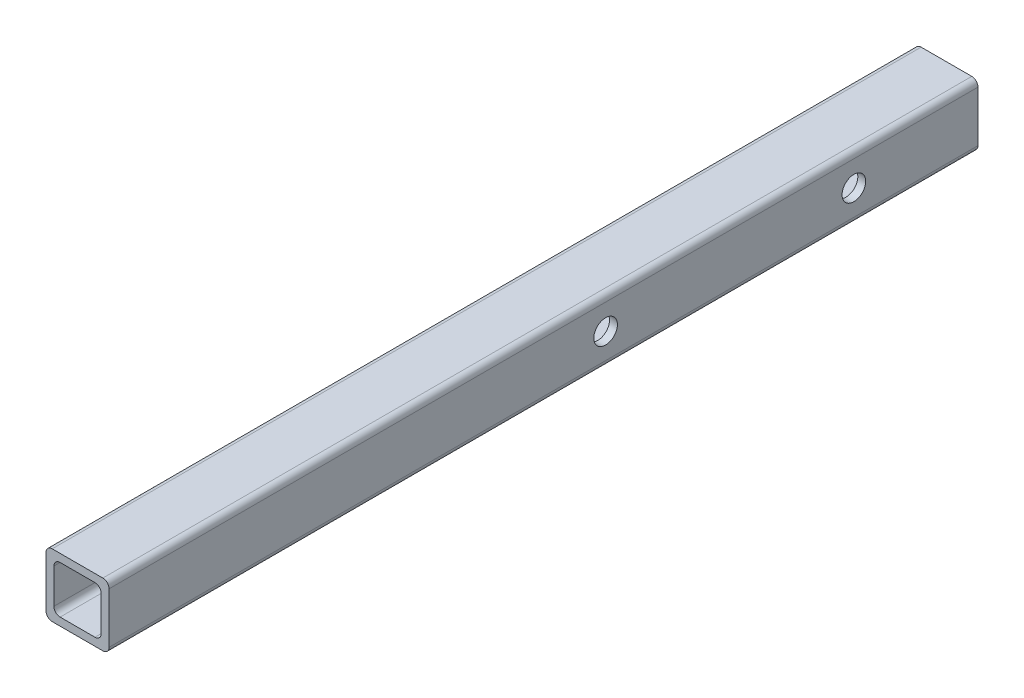
ISO-10303-21;
HEADER;
FILE_DESCRIPTION(('STEP AP214'),'2;1');
FILE_NAME('part.step','',(''),(''),'','','');
FILE_SCHEMA(('AUTOMOTIVE_DESIGN { 1 0 10303 214 1 1 1 1 }'));
ENDSEC;
DATA;
#1=APPLICATION_CONTEXT('core data for automotive mechanical design processes');
#2=APPLICATION_PROTOCOL_DEFINITION('international standard','automotive_design',2000,#1);
#3=PRODUCT_CONTEXT('',#1,'mechanical');
#4=PRODUCT('Part','Part','',(#3));
#5=PRODUCT_RELATED_PRODUCT_CATEGORY('part','',(#4));
#6=PRODUCT_DEFINITION_FORMATION('','',#4);
#7=PRODUCT_DEFINITION_CONTEXT('part definition',#1,'design');
#8=PRODUCT_DEFINITION('design','',#6,#7);
#9=PRODUCT_DEFINITION_SHAPE('','',#8);
#10=(LENGTH_UNIT() NAMED_UNIT(*) SI_UNIT(.MILLI.,.METRE.));
#11=(NAMED_UNIT(*) PLANE_ANGLE_UNIT() SI_UNIT($,.RADIAN.));
#12=(NAMED_UNIT(*) SI_UNIT($,.STERADIAN.) SOLID_ANGLE_UNIT());
#13=UNCERTAINTY_MEASURE_WITH_UNIT(LENGTH_MEASURE(1.E-05),#10,'distance_accuracy_value','');
#14=(GEOMETRIC_REPRESENTATION_CONTEXT(3) GLOBAL_UNCERTAINTY_ASSIGNED_CONTEXT((#13)) GLOBAL_UNIT_ASSIGNED_CONTEXT((#10,
#11,#12)) REPRESENTATION_CONTEXT('',''));
#15=CARTESIAN_POINT('',(0.,0.,0.));
#16=DIRECTION('',(0.,0.,1.));
#17=DIRECTION('',(1.,0.,0.));
#18=AXIS2_PLACEMENT_3D('',#15,#16,#17);
#19=CARTESIAN_POINT('',(10.2,-10.2,350.));
#20=DIRECTION('',(0.,0.,-1.));
#21=DIRECTION('',(-1.,0.,0.));
#22=AXIS2_PLACEMENT_3D('',#19,#20,#21);
#23=PLANE('',#22);
#24=CARTESIAN_POINT('',(10.2,-10.2,350.));
#25=DIRECTION('',(0.,0.,1.));
#26=DIRECTION('',(-1.,0.,0.));
#27=AXIS2_PLACEMENT_3D('',#24,#25,#26);
#28=CIRCLE('',#27,2.5);
#29=CARTESIAN_POINT('',(10.2,-12.7,350.));
#30=VERTEX_POINT('',#29);
#31=CARTESIAN_POINT('',(12.7,-10.2,350.));
#32=VERTEX_POINT('',#31);
#33=EDGE_CURVE('E245',#30,#32,#28,.T.);
#34=ORIENTED_EDGE('',*,*,#33,.T.);
#35=DIRECTION('',(0.,1.,0.));
#36=VECTOR('',#35,1.);
#37=CARTESIAN_POINT('',(12.7,-10.2,350.));
#38=LINE('',#37,#36);
#39=CARTESIAN_POINT('',(12.7,10.2,350.));
#40=VERTEX_POINT('',#39);
#41=EDGE_CURVE('E249',#32,#40,#38,.T.);
#42=ORIENTED_EDGE('',*,*,#41,.T.);
#43=CARTESIAN_POINT('',(10.2,10.2,350.));
#44=DIRECTION('',(0.,0.,1.));
#45=DIRECTION('',(1.,0.,0.));
#46=AXIS2_PLACEMENT_3D('',#43,#44,#45);
#47=CIRCLE('',#46,2.5);
#48=CARTESIAN_POINT('',(10.2,12.7,350.));
#49=VERTEX_POINT('',#48);
#50=EDGE_CURVE('E253',#40,#49,#47,.T.);
#51=ORIENTED_EDGE('',*,*,#50,.T.);
#52=DIRECTION('',(-1.,0.,0.));
#53=VECTOR('',#52,1.);
#54=CARTESIAN_POINT('',(-10.2,12.7,350.));
#55=LINE('',#54,#53);
#56=CARTESIAN_POINT('',(-10.2,12.7,350.));
#57=VERTEX_POINT('',#56);
#58=EDGE_CURVE('E256',#49,#57,#55,.T.);
#59=ORIENTED_EDGE('',*,*,#58,.T.);
#60=CARTESIAN_POINT('',(-10.2,10.2,350.));
#61=DIRECTION('',(0.,0.,1.));
#62=DIRECTION('',(1.,0.,0.));
#63=AXIS2_PLACEMENT_3D('',#60,#61,#62);
#64=CIRCLE('',#63,2.5);
#65=CARTESIAN_POINT('',(-12.7,10.2,350.));
#66=VERTEX_POINT('',#65);
#67=EDGE_CURVE('E259',#57,#66,#64,.T.);
#68=ORIENTED_EDGE('',*,*,#67,.T.);
#69=DIRECTION('',(0.,-1.,0.));
#70=VECTOR('',#69,1.);
#71=CARTESIAN_POINT('',(-12.7,-10.2,350.));
#72=LINE('',#71,#70);
#73=CARTESIAN_POINT('',(-12.7,-10.2,350.));
#74=VERTEX_POINT('',#73);
#75=EDGE_CURVE('E262',#66,#74,#72,.T.);
#76=ORIENTED_EDGE('',*,*,#75,.T.);
#77=CARTESIAN_POINT('',(-10.2,-10.2,350.));
#78=DIRECTION('',(0.,0.,1.));
#79=DIRECTION('',(-1.,0.,0.));
#80=AXIS2_PLACEMENT_3D('',#77,#78,#79);
#81=CIRCLE('',#80,2.5);
#82=CARTESIAN_POINT('',(-10.2,-12.7,350.));
#83=VERTEX_POINT('',#82);
#84=EDGE_CURVE('E265',#74,#83,#81,.T.);
#85=ORIENTED_EDGE('',*,*,#84,.T.);
#86=DIRECTION('',(1.,0.,0.));
#87=VECTOR('',#86,1.);
#88=CARTESIAN_POINT('',(-10.2,-12.7,350.));
#89=LINE('',#88,#87);
#90=EDGE_CURVE('E268',#83,#30,#89,.T.);
#91=ORIENTED_EDGE('',*,*,#90,.T.);
#92=EDGE_LOOP('',(#34,#42,#51,#59,#68,#76,#85,#91));
#93=FACE_BOUND('',#92,.T.);
#94=CARTESIAN_POINT('',(-7.02500000000001,-7.02499999999998,350.));
#95=DIRECTION('',(0.,0.,1.));
#96=DIRECTION('',(-1.,0.,0.));
#97=AXIS2_PLACEMENT_3D('',#94,#95,#96);
#98=CIRCLE('',#97,2.5);
#99=CARTESIAN_POINT('',(-9.52500000000001,-7.02499999999998,350.));
#100=VERTEX_POINT('',#99);
#101=CARTESIAN_POINT('',(-7.02500000000001,-9.52499999999998,350.));
#102=VERTEX_POINT('',#101);
#103=EDGE_CURVE('E154',#100,#102,#98,.T.);
#104=ORIENTED_EDGE('',*,*,#103,.F.);
#105=DIRECTION('',(0.,-1.,0.));
#106=VECTOR('',#105,1.);
#107=CARTESIAN_POINT('',(-9.52500000000001,-7.02499999999998,350.));
#108=LINE('',#107,#106);
#109=CARTESIAN_POINT('',(-9.52500000000001,7.025,350.));
#110=VERTEX_POINT('',#109);
#111=EDGE_CURVE('E196',#110,#100,#108,.T.);
#112=ORIENTED_EDGE('',*,*,#111,.F.);
#113=CARTESIAN_POINT('',(-7.025,7.025,350.));
#114=DIRECTION('',(0.,0.,1.));
#115=DIRECTION('',(-1.,0.,0.));
#116=AXIS2_PLACEMENT_3D('',#113,#114,#115);
#117=CIRCLE('',#116,2.5);
#118=CARTESIAN_POINT('',(-7.025,9.52500000000001,350.));
#119=VERTEX_POINT('',#118);
#120=EDGE_CURVE('E193',#119,#110,#117,.T.);
#121=ORIENTED_EDGE('',*,*,#120,.F.);
#122=DIRECTION('',(-1.,0.,0.));
#123=VECTOR('',#122,1.);
#124=CARTESIAN_POINT('',(-7.025,9.52500000000001,350.));
#125=LINE('',#124,#123);
#126=CARTESIAN_POINT('',(7.02499999999999,9.52500000000001,350.));
#127=VERTEX_POINT('',#126);
#128=EDGE_CURVE('E190',#127,#119,#125,.T.);
#129=ORIENTED_EDGE('',*,*,#128,.F.);
#130=CARTESIAN_POINT('',(7.02499999999999,7.025,350.));
#131=DIRECTION('',(0.,0.,1.));
#132=DIRECTION('',(1.,0.,0.));
#133=AXIS2_PLACEMENT_3D('',#130,#131,#132);
#134=CIRCLE('',#133,2.5);
#135=CARTESIAN_POINT('',(9.52499999999999,7.025,350.));
#136=VERTEX_POINT('',#135);
#137=EDGE_CURVE('E187',#136,#127,#134,.T.);
#138=ORIENTED_EDGE('',*,*,#137,.F.);
#139=DIRECTION('',(0.,1.,0.));
#140=VECTOR('',#139,1.);
#141=CARTESIAN_POINT('',(9.52499999999999,-7.02499999999998,350.));
#142=LINE('',#141,#140);
#143=CARTESIAN_POINT('',(9.52499999999999,-7.02499999999998,350.));
#144=VERTEX_POINT('',#143);
#145=EDGE_CURVE('E181',#144,#136,#142,.T.);
#146=ORIENTED_EDGE('',*,*,#145,.F.);
#147=CARTESIAN_POINT('',(7.02499999999999,-7.02499999999998,350.));
#148=DIRECTION('',(0.,0.,1.));
#149=DIRECTION('',(1.,0.,0.));
#150=AXIS2_PLACEMENT_3D('',#147,#148,#149);
#151=CIRCLE('',#150,2.5);
#152=CARTESIAN_POINT('',(7.02499999999999,-9.52499999999998,350.));
#153=VERTEX_POINT('',#152);
#154=EDGE_CURVE('E177',#153,#144,#151,.T.);
#155=ORIENTED_EDGE('',*,*,#154,.F.);
#156=DIRECTION('',(1.,0.,0.));
#157=VECTOR('',#156,1.);
#158=CARTESIAN_POINT('',(-7.02500000000001,-9.52499999999998,350.));
#159=LINE('',#158,#157);
#160=EDGE_CURVE('E163',#102,#153,#159,.T.);
#161=ORIENTED_EDGE('',*,*,#160,.F.);
#162=EDGE_LOOP('',(#104,#112,#121,#129,#138,#146,#155,#161));
#163=FACE_BOUND('',#162,.T.);
#164=ADVANCED_FACE('F38',(#93,#163),#23,.F.);
#165=CARTESIAN_POINT('',(10.2,-10.2,0.));
#166=DIRECTION('',(0.,0.,-1.));
#167=DIRECTION('',(-1.,0.,0.));
#168=AXIS2_PLACEMENT_3D('',#165,#166,#167);
#169=PLANE('',#168);
#170=CARTESIAN_POINT('',(10.2,-10.2,0.));
#171=DIRECTION('',(0.,0.,1.));
#172=DIRECTION('',(-1.,0.,0.));
#173=AXIS2_PLACEMENT_3D('',#170,#171,#172);
#174=CIRCLE('',#173,2.5);
#175=CARTESIAN_POINT('',(10.2,-12.7,0.));
#176=VERTEX_POINT('',#175);
#177=CARTESIAN_POINT('',(12.7,-10.2,0.));
#178=VERTEX_POINT('',#177);
#179=EDGE_CURVE('E172',#176,#178,#174,.T.);
#180=ORIENTED_EDGE('',*,*,#179,.F.);
#181=DIRECTION('',(1.,0.,0.));
#182=VECTOR('',#181,1.);
#183=CARTESIAN_POINT('',(-10.2,-12.7,0.));
#184=LINE('',#183,#182);
#185=CARTESIAN_POINT('',(-10.2,-12.7,0.));
#186=VERTEX_POINT('',#185);
#187=EDGE_CURVE('E250',#186,#176,#184,.T.);
#188=ORIENTED_EDGE('',*,*,#187,.F.);
#189=CARTESIAN_POINT('',(-10.2,-10.2,0.));
#190=DIRECTION('',(0.,0.,1.));
#191=DIRECTION('',(-1.,0.,0.));
#192=AXIS2_PLACEMENT_3D('',#189,#190,#191);
#193=CIRCLE('',#192,2.5);
#194=CARTESIAN_POINT('',(-12.7,-10.2,0.));
#195=VERTEX_POINT('',#194);
#196=EDGE_CURVE('E290',#195,#186,#193,.T.);
#197=ORIENTED_EDGE('',*,*,#196,.F.);
#198=DIRECTION('',(0.,-1.,0.));
#199=VECTOR('',#198,1.);
#200=CARTESIAN_POINT('',(-12.7,-10.2,0.));
#201=LINE('',#200,#199);
#202=CARTESIAN_POINT('',(-12.7,10.2,0.));
#203=VERTEX_POINT('',#202);
#204=EDGE_CURVE('E287',#203,#195,#201,.T.);
#205=ORIENTED_EDGE('',*,*,#204,.F.);
#206=CARTESIAN_POINT('',(-10.2,10.2,0.));
#207=DIRECTION('',(0.,0.,1.));
#208=DIRECTION('',(1.,0.,0.));
#209=AXIS2_PLACEMENT_3D('',#206,#207,#208);
#210=CIRCLE('',#209,2.5);
#211=CARTESIAN_POINT('',(-10.2,12.7,0.));
#212=VERTEX_POINT('',#211);
#213=EDGE_CURVE('E284',#212,#203,#210,.T.);
#214=ORIENTED_EDGE('',*,*,#213,.F.);
#215=DIRECTION('',(-1.,0.,0.));
#216=VECTOR('',#215,1.);
#217=CARTESIAN_POINT('',(-10.2,12.7,0.));
#218=LINE('',#217,#216);
#219=CARTESIAN_POINT('',(10.2,12.7,0.));
#220=VERTEX_POINT('',#219);
#221=EDGE_CURVE('E281',#220,#212,#218,.T.);
#222=ORIENTED_EDGE('',*,*,#221,.F.);
#223=CARTESIAN_POINT('',(10.2,10.2,0.));
#224=DIRECTION('',(0.,0.,1.));
#225=DIRECTION('',(1.,0.,0.));
#226=AXIS2_PLACEMENT_3D('',#223,#224,#225);
#227=CIRCLE('',#226,2.5);
#228=CARTESIAN_POINT('',(12.7,10.2,0.));
#229=VERTEX_POINT('',#228);
#230=EDGE_CURVE('E278',#229,#220,#227,.T.);
#231=ORIENTED_EDGE('',*,*,#230,.F.);
#232=DIRECTION('',(0.,1.,0.));
#233=VECTOR('',#232,1.);
#234=CARTESIAN_POINT('',(12.7,-10.2,0.));
#235=LINE('',#234,#233);
#236=EDGE_CURVE('E275',#178,#229,#235,.T.);
#237=ORIENTED_EDGE('',*,*,#236,.F.);
#238=EDGE_LOOP('',(#180,#188,#197,#205,#214,#222,#231,#237));
#239=FACE_BOUND('',#238,.T.);
#240=DIRECTION('',(0.,-1.,0.));
#241=VECTOR('',#240,1.);
#242=CARTESIAN_POINT('',(-9.52500000000001,-7.02499999999998,0.));
#243=LINE('',#242,#241);
#244=CARTESIAN_POINT('',(-9.52500000000001,7.02500000000001,0.));
#245=VERTEX_POINT('',#244);
#246=CARTESIAN_POINT('',(-9.52500000000001,-7.02499999999998,0.));
#247=VERTEX_POINT('',#246);
#248=EDGE_CURVE('E164',#245,#247,#243,.T.);
#249=ORIENTED_EDGE('',*,*,#248,.T.);
#250=CARTESIAN_POINT('',(-7.02500000000001,-7.02499999999998,0.));
#251=DIRECTION('',(0.,0.,1.));
#252=DIRECTION('',(-1.,0.,0.));
#253=AXIS2_PLACEMENT_3D('',#250,#251,#252);
#254=CIRCLE('',#253,2.5);
#255=CARTESIAN_POINT('',(-7.02500000000001,-9.52499999999998,0.));
#256=VERTEX_POINT('',#255);
#257=EDGE_CURVE('E64',#247,#256,#254,.T.);
#258=ORIENTED_EDGE('',*,*,#257,.T.);
#259=DIRECTION('',(1.,0.,0.));
#260=VECTOR('',#259,1.);
#261=CARTESIAN_POINT('',(-7.02500000000001,-9.52499999999998,0.));
#262=LINE('',#261,#260);
#263=CARTESIAN_POINT('',(7.02499999999999,-9.52499999999998,0.));
#264=VERTEX_POINT('',#263);
#265=EDGE_CURVE('E170',#256,#264,#262,.T.);
#266=ORIENTED_EDGE('',*,*,#265,.T.);
#267=CARTESIAN_POINT('',(7.02499999999999,-7.02499999999998,0.));
#268=DIRECTION('',(0.,0.,1.));
#269=DIRECTION('',(1.,0.,0.));
#270=AXIS2_PLACEMENT_3D('',#267,#268,#269);
#271=CIRCLE('',#270,2.5);
#272=CARTESIAN_POINT('',(9.52499999999999,-7.02499999999998,0.));
#273=VERTEX_POINT('',#272);
#274=EDGE_CURVE('E204',#264,#273,#271,.T.);
#275=ORIENTED_EDGE('',*,*,#274,.T.);
#276=DIRECTION('',(0.,1.,0.));
#277=VECTOR('',#276,1.);
#278=CARTESIAN_POINT('',(9.52499999999999,-7.02499999999998,0.));
#279=LINE('',#278,#277);
#280=CARTESIAN_POINT('',(9.52499999999999,7.025,0.));
#281=VERTEX_POINT('',#280);
#282=EDGE_CURVE('E208',#273,#281,#279,.T.);
#283=ORIENTED_EDGE('',*,*,#282,.T.);
#284=CARTESIAN_POINT('',(7.02499999999999,7.025,0.));
#285=DIRECTION('',(0.,0.,1.));
#286=DIRECTION('',(1.,0.,0.));
#287=AXIS2_PLACEMENT_3D('',#284,#285,#286);
#288=CIRCLE('',#287,2.5);
#289=CARTESIAN_POINT('',(7.02499999999999,9.52500000000001,0.));
#290=VERTEX_POINT('',#289);
#291=EDGE_CURVE('E212',#281,#290,#288,.T.);
#292=ORIENTED_EDGE('',*,*,#291,.T.);
#293=DIRECTION('',(-1.,0.,0.));
#294=VECTOR('',#293,1.);
#295=CARTESIAN_POINT('',(-7.025,9.52500000000001,0.));
#296=LINE('',#295,#294);
#297=CARTESIAN_POINT('',(-7.025,9.52500000000001,0.));
#298=VERTEX_POINT('',#297);
#299=EDGE_CURVE('E216',#290,#298,#296,.T.);
#300=ORIENTED_EDGE('',*,*,#299,.T.);
#301=CARTESIAN_POINT('',(-7.025,7.025,0.));
#302=DIRECTION('',(0.,0.,1.));
#303=DIRECTION('',(-1.,0.,0.));
#304=AXIS2_PLACEMENT_3D('',#301,#302,#303);
#305=CIRCLE('',#304,2.5);
#306=EDGE_CURVE('E220',#298,#245,#305,.T.);
#307=ORIENTED_EDGE('',*,*,#306,.T.);
#308=EDGE_LOOP('',(#249,#258,#266,#275,#283,#292,#300,#307));
#309=FACE_BOUND('',#308,.T.);
#310=ADVANCED_FACE('F366',(#239,#309),#169,.T.);
#311=CARTESIAN_POINT('',(10.2,-10.2,350.));
#312=DIRECTION('',(0.,0.,-1.));
#313=DIRECTION('',(-1.,0.,0.));
#314=AXIS2_PLACEMENT_3D('',#311,#312,#313);
#315=CYLINDRICAL_SURFACE('',#314,2.5);
#316=ORIENTED_EDGE('',*,*,#179,.T.);
#317=DIRECTION('',(0.,0.,-1.));
#318=VECTOR('',#317,1.);
#319=CARTESIAN_POINT('',(12.7,-10.2,350.));
#320=LINE('',#319,#318);
#321=EDGE_CURVE('E11',#32,#178,#320,.T.);
#322=ORIENTED_EDGE('',*,*,#321,.F.);
#323=ORIENTED_EDGE('',*,*,#33,.F.);
#324=DIRECTION('',(0.,0.,-1.));
#325=VECTOR('',#324,1.);
#326=CARTESIAN_POINT('',(10.2,-12.7,350.));
#327=LINE('',#326,#325);
#328=EDGE_CURVE('E271',#30,#176,#327,.T.);
#329=ORIENTED_EDGE('',*,*,#328,.T.);
#330=EDGE_LOOP('',(#316,#322,#323,#329));
#331=FACE_BOUND('',#330,.T.);
#332=ADVANCED_FACE('F40',(#331),#315,.T.);
#333=CARTESIAN_POINT('',(12.7,-10.2,350.));
#334=DIRECTION('',(-1.,0.,0.));
#335=DIRECTION('',(0.,-1.,0.));
#336=AXIS2_PLACEMENT_3D('',#333,#334,#335);
#337=PLANE('',#336);
#338=CARTESIAN_POINT('',(12.7,0.,50.));
#339=DIRECTION('',(-1.,0.,0.));
#340=DIRECTION('',(0.,0.,1.));
#341=AXIS2_PLACEMENT_3D('',#338,#339,#340);
#342=CIRCLE('',#341,4.7625);
#343=CARTESIAN_POINT('',(12.7,0.,54.7625));
#344=VERTEX_POINT('',#343);
#345=EDGE_CURVE('E324',#344,#344,#342,.T.);
#346=ORIENTED_EDGE('',*,*,#345,.T.);
#347=EDGE_LOOP('',(#346));
#348=FACE_BOUND('',#347,.T.);
#349=CARTESIAN_POINT('',(12.7,0.,150.));
#350=DIRECTION('',(-1.,0.,0.));
#351=DIRECTION('',(0.,0.,1.));
#352=AXIS2_PLACEMENT_3D('',#349,#350,#351);
#353=CIRCLE('',#352,4.76250000000001);
#354=CARTESIAN_POINT('',(12.7,0.,154.7625));
#355=VERTEX_POINT('',#354);
#356=EDGE_CURVE('E338',#355,#355,#353,.T.);
#357=ORIENTED_EDGE('',*,*,#356,.T.);
#358=EDGE_LOOP('',(#357));
#359=FACE_BOUND('',#358,.T.);
#360=ORIENTED_EDGE('',*,*,#236,.T.);
#361=DIRECTION('',(0.,0.,-1.));
#362=VECTOR('',#361,1.);
#363=CARTESIAN_POINT('',(12.7,10.2,350.));
#364=LINE('',#363,#362);
#365=EDGE_CURVE('E48',#40,#229,#364,.T.);
#366=ORIENTED_EDGE('',*,*,#365,.F.);
#367=ORIENTED_EDGE('',*,*,#41,.F.);
#368=ORIENTED_EDGE('',*,*,#321,.T.);
#369=EDGE_LOOP('',(#360,#366,#367,#368));
#370=FACE_BOUND('',#369,.T.);
#371=ADVANCED_FACE('F429',(#348,#359,#370),#337,.F.);
#372=CARTESIAN_POINT('',(10.2,10.2,350.));
#373=DIRECTION('',(0.,0.,-1.));
#374=DIRECTION('',(-1.,0.,0.));
#375=AXIS2_PLACEMENT_3D('',#372,#373,#374);
#376=CYLINDRICAL_SURFACE('',#375,2.5);
#377=ORIENTED_EDGE('',*,*,#230,.T.);
#378=DIRECTION('',(0.,0.,-1.));
#379=VECTOR('',#378,1.);
#380=CARTESIAN_POINT('',(10.2,12.7,350.));
#381=LINE('',#380,#379);
#382=EDGE_CURVE('E314',#49,#220,#381,.T.);
#383=ORIENTED_EDGE('',*,*,#382,.F.);
#384=ORIENTED_EDGE('',*,*,#50,.F.);
#385=ORIENTED_EDGE('',*,*,#365,.T.);
#386=EDGE_LOOP('',(#377,#383,#384,#385));
#387=FACE_BOUND('',#386,.T.);
#388=ADVANCED_FACE('F426',(#387),#376,.T.);
#389=CARTESIAN_POINT('',(-10.2,12.7,350.));
#390=DIRECTION('',(0.,-1.,0.));
#391=DIRECTION('',(1.,0.,0.));
#392=AXIS2_PLACEMENT_3D('',#389,#390,#391);
#393=PLANE('',#392);
#394=ORIENTED_EDGE('',*,*,#221,.T.);
#395=DIRECTION('',(0.,0.,-1.));
#396=VECTOR('',#395,1.);
#397=CARTESIAN_POINT('',(-10.2,12.7,350.));
#398=LINE('',#397,#396);
#399=EDGE_CURVE('E310',#57,#212,#398,.T.);
#400=ORIENTED_EDGE('',*,*,#399,.F.);
#401=ORIENTED_EDGE('',*,*,#58,.F.);
#402=ORIENTED_EDGE('',*,*,#382,.T.);
#403=EDGE_LOOP('',(#394,#400,#401,#402));
#404=FACE_BOUND('',#403,.T.);
#405=ADVANCED_FACE('F422',(#404),#393,.F.);
#406=CARTESIAN_POINT('',(-10.2,10.2,350.));
#407=DIRECTION('',(0.,0.,-1.));
#408=DIRECTION('',(-1.,0.,0.));
#409=AXIS2_PLACEMENT_3D('',#406,#407,#408);
#410=CYLINDRICAL_SURFACE('',#409,2.5);
#411=ORIENTED_EDGE('',*,*,#213,.T.);
#412=DIRECTION('',(0.,0.,-1.));
#413=VECTOR('',#412,1.);
#414=CARTESIAN_POINT('',(-12.7,10.2,350.));
#415=LINE('',#414,#413);
#416=EDGE_CURVE('E306',#66,#203,#415,.T.);
#417=ORIENTED_EDGE('',*,*,#416,.F.);
#418=ORIENTED_EDGE('',*,*,#67,.F.);
#419=ORIENTED_EDGE('',*,*,#399,.T.);
#420=EDGE_LOOP('',(#411,#417,#418,#419));
#421=FACE_BOUND('',#420,.T.);
#422=ADVANCED_FACE('F418',(#421),#410,.T.);
#423=CARTESIAN_POINT('',(-12.7,-10.2,350.));
#424=DIRECTION('',(1.,0.,0.));
#425=DIRECTION('',(0.,0.,-1.));
#426=AXIS2_PLACEMENT_3D('',#423,#424,#425);
#427=PLANE('',#426);
#428=CARTESIAN_POINT('',(-12.7,0.,50.));
#429=DIRECTION('',(-1.,0.,0.));
#430=DIRECTION('',(0.,0.,1.));
#431=AXIS2_PLACEMENT_3D('',#428,#429,#430);
#432=CIRCLE('',#431,4.7625);
#433=CARTESIAN_POINT('',(-12.7,0.,54.7625));
#434=VERTEX_POINT('',#433);
#435=EDGE_CURVE('E332',#434,#434,#432,.T.);
#436=ORIENTED_EDGE('',*,*,#435,.F.);
#437=EDGE_LOOP('',(#436));
#438=FACE_BOUND('',#437,.T.);
#439=CARTESIAN_POINT('',(-12.7,0.,150.));
#440=DIRECTION('',(-1.,0.,0.));
#441=DIRECTION('',(0.,0.,1.));
#442=AXIS2_PLACEMENT_3D('',#439,#440,#441);
#443=CIRCLE('',#442,4.76250000000001);
#444=CARTESIAN_POINT('',(-12.7,0.,154.7625));
#445=VERTEX_POINT('',#444);
#446=EDGE_CURVE('E344',#445,#445,#443,.T.);
#447=ORIENTED_EDGE('',*,*,#446,.F.);
#448=EDGE_LOOP('',(#447));
#449=FACE_BOUND('',#448,.T.);
#450=ORIENTED_EDGE('',*,*,#204,.T.);
#451=DIRECTION('',(0.,0.,-1.));
#452=VECTOR('',#451,1.);
#453=CARTESIAN_POINT('',(-12.7,-10.2,350.));
#454=LINE('',#453,#452);
#455=EDGE_CURVE('E302',#74,#195,#454,.T.);
#456=ORIENTED_EDGE('',*,*,#455,.F.);
#457=ORIENTED_EDGE('',*,*,#75,.F.);
#458=ORIENTED_EDGE('',*,*,#416,.T.);
#459=EDGE_LOOP('',(#450,#456,#457,#458));
#460=FACE_BOUND('',#459,.T.);
#461=ADVANCED_FACE('F414',(#438,#449,#460),#427,.F.);
#462=CARTESIAN_POINT('',(-10.2,-10.2,350.));
#463=DIRECTION('',(0.,0.,-1.));
#464=DIRECTION('',(-1.,0.,0.));
#465=AXIS2_PLACEMENT_3D('',#462,#463,#464);
#466=CYLINDRICAL_SURFACE('',#465,2.5);
#467=ORIENTED_EDGE('',*,*,#196,.T.);
#468=DIRECTION('',(0.,0.,-1.));
#469=VECTOR('',#468,1.);
#470=CARTESIAN_POINT('',(-10.2,-12.7,350.));
#471=LINE('',#470,#469);
#472=EDGE_CURVE('E298',#83,#186,#471,.T.);
#473=ORIENTED_EDGE('',*,*,#472,.F.);
#474=ORIENTED_EDGE('',*,*,#84,.F.);
#475=ORIENTED_EDGE('',*,*,#455,.T.);
#476=EDGE_LOOP('',(#467,#473,#474,#475));
#477=FACE_BOUND('',#476,.T.);
#478=ADVANCED_FACE('F410',(#477),#466,.T.);
#479=CARTESIAN_POINT('',(-10.2,-12.7,350.));
#480=DIRECTION('',(0.,1.,0.));
#481=DIRECTION('',(0.,0.,1.));
#482=AXIS2_PLACEMENT_3D('',#479,#480,#481);
#483=PLANE('',#482);
#484=ORIENTED_EDGE('',*,*,#187,.T.);
#485=ORIENTED_EDGE('',*,*,#328,.F.);
#486=ORIENTED_EDGE('',*,*,#90,.F.);
#487=ORIENTED_EDGE('',*,*,#472,.T.);
#488=EDGE_LOOP('',(#484,#485,#486,#487));
#489=FACE_BOUND('',#488,.T.);
#490=ADVANCED_FACE('F407',(#489),#483,.F.);
#491=CARTESIAN_POINT('',(-7.02500000000001,-7.02499999999998,350.));
#492=DIRECTION('',(0.,0.,-1.));
#493=DIRECTION('',(-1.,0.,0.));
#494=AXIS2_PLACEMENT_3D('',#491,#492,#493);
#495=CYLINDRICAL_SURFACE('',#494,2.5);
#496=ORIENTED_EDGE('',*,*,#257,.F.);
#497=DIRECTION('',(0.,0.,-1.));
#498=VECTOR('',#497,1.);
#499=CARTESIAN_POINT('',(-9.52500000000001,-7.02499999999998,350.));
#500=LINE('',#499,#498);
#501=EDGE_CURVE('E158',#100,#247,#500,.T.);
#502=ORIENTED_EDGE('',*,*,#501,.F.);
#503=ORIENTED_EDGE('',*,*,#103,.T.);
#504=DIRECTION('',(0.,0.,-1.));
#505=VECTOR('',#504,1.);
#506=CARTESIAN_POINT('',(-7.02500000000001,-9.52499999999998,350.));
#507=LINE('',#506,#505);
#508=EDGE_CURVE('E157',#102,#256,#507,.T.);
#509=ORIENTED_EDGE('',*,*,#508,.T.);
#510=EDGE_LOOP('',(#496,#502,#503,#509));
#511=FACE_BOUND('',#510,.T.);
#512=ADVANCED_FACE('F156',(#511),#495,.F.);
#513=CARTESIAN_POINT('',(-7.02500000000001,-9.52499999999998,350.));
#514=DIRECTION('',(0.,1.,0.));
#515=DIRECTION('',(0.,0.,1.));
#516=AXIS2_PLACEMENT_3D('',#513,#514,#515);
#517=PLANE('',#516);
#518=ORIENTED_EDGE('',*,*,#265,.F.);
#519=ORIENTED_EDGE('',*,*,#508,.F.);
#520=ORIENTED_EDGE('',*,*,#160,.T.);
#521=DIRECTION('',(0.,0.,-1.));
#522=VECTOR('',#521,1.);
#523=CARTESIAN_POINT('',(7.02499999999999,-9.52499999999998,350.));
#524=LINE('',#523,#522);
#525=EDGE_CURVE('E173',#153,#264,#524,.T.);
#526=ORIENTED_EDGE('',*,*,#525,.T.);
#527=EDGE_LOOP('',(#518,#519,#520,#526));
#528=FACE_BOUND('',#527,.T.);
#529=ADVANCED_FACE('F167',(#528),#517,.T.);
#530=CARTESIAN_POINT('',(7.02499999999999,-7.02499999999998,350.));
#531=DIRECTION('',(0.,0.,-1.));
#532=DIRECTION('',(-1.,0.,0.));
#533=AXIS2_PLACEMENT_3D('',#530,#531,#532);
#534=CYLINDRICAL_SURFACE('',#533,2.5);
#535=ORIENTED_EDGE('',*,*,#274,.F.);
#536=ORIENTED_EDGE('',*,*,#525,.F.);
#537=ORIENTED_EDGE('',*,*,#154,.T.);
#538=DIRECTION('',(0.,0.,-1.));
#539=VECTOR('',#538,1.);
#540=CARTESIAN_POINT('',(9.52499999999999,-7.02499999999998,350.));
#541=LINE('',#540,#539);
#542=EDGE_CURVE('E240',#144,#273,#541,.T.);
#543=ORIENTED_EDGE('',*,*,#542,.T.);
#544=EDGE_LOOP('',(#535,#536,#537,#543));
#545=FACE_BOUND('',#544,.T.);
#546=ADVANCED_FACE('F386',(#545),#534,.F.);
#547=CARTESIAN_POINT('',(9.52499999999999,-7.02499999999998,350.));
#548=DIRECTION('',(-1.,0.,0.));
#549=DIRECTION('',(0.,-1.,0.));
#550=AXIS2_PLACEMENT_3D('',#547,#548,#549);
#551=PLANE('',#550);
#552=CARTESIAN_POINT('',(9.52499999999999,0.,50.));
#553=DIRECTION('',(-1.,0.,0.));
#554=DIRECTION('',(0.,-1.,0.));
#555=AXIS2_PLACEMENT_3D('',#552,#553,#554);
#556=CIRCLE('',#555,4.7625);
#557=CARTESIAN_POINT('',(9.52499999999999,-4.7625,50.));
#558=VERTEX_POINT('',#557);
#559=EDGE_CURVE('E201',#558,#558,#556,.T.);
#560=ORIENTED_EDGE('',*,*,#559,.F.);
#561=EDGE_LOOP('',(#560));
#562=FACE_BOUND('',#561,.T.);
#563=CARTESIAN_POINT('',(9.52499999999999,0.,150.));
#564=DIRECTION('',(-1.,0.,0.));
#565=DIRECTION('',(0.,-1.,0.));
#566=AXIS2_PLACEMENT_3D('',#563,#564,#565);
#567=CIRCLE('',#566,4.76250000000001);
#568=CARTESIAN_POINT('',(9.52499999999999,-4.76250000000001,150.));
#569=VERTEX_POINT('',#568);
#570=EDGE_CURVE('E323',#569,#569,#567,.T.);
#571=ORIENTED_EDGE('',*,*,#570,.F.);
#572=EDGE_LOOP('',(#571));
#573=FACE_BOUND('',#572,.T.);
#574=ORIENTED_EDGE('',*,*,#282,.F.);
#575=ORIENTED_EDGE('',*,*,#542,.F.);
#576=ORIENTED_EDGE('',*,*,#145,.T.);
#577=DIRECTION('',(0.,0.,-1.));
#578=VECTOR('',#577,1.);
#579=CARTESIAN_POINT('',(9.52499999999999,7.025,350.));
#580=LINE('',#579,#578);
#581=EDGE_CURVE('E237',#136,#281,#580,.T.);
#582=ORIENTED_EDGE('',*,*,#581,.T.);
#583=EDGE_LOOP('',(#574,#575,#576,#582));
#584=FACE_BOUND('',#583,.T.);
#585=ADVANCED_FACE('F382',(#562,#573,#584),#551,.T.);
#586=CARTESIAN_POINT('',(7.02499999999999,7.025,350.));
#587=DIRECTION('',(0.,0.,-1.));
#588=DIRECTION('',(-1.,0.,0.));
#589=AXIS2_PLACEMENT_3D('',#586,#587,#588);
#590=CYLINDRICAL_SURFACE('',#589,2.5);
#591=ORIENTED_EDGE('',*,*,#291,.F.);
#592=ORIENTED_EDGE('',*,*,#581,.F.);
#593=ORIENTED_EDGE('',*,*,#137,.T.);
#594=DIRECTION('',(0.,0.,-1.));
#595=VECTOR('',#594,1.);
#596=CARTESIAN_POINT('',(7.02499999999999,9.52500000000001,350.));
#597=LINE('',#596,#595);
#598=EDGE_CURVE('E234',#127,#290,#597,.T.);
#599=ORIENTED_EDGE('',*,*,#598,.T.);
#600=EDGE_LOOP('',(#591,#592,#593,#599));
#601=FACE_BOUND('',#600,.T.);
#602=ADVANCED_FACE('F378',(#601),#590,.F.);
#603=CARTESIAN_POINT('',(-7.025,9.52500000000001,350.));
#604=DIRECTION('',(0.,-1.,0.));
#605=DIRECTION('',(0.,0.,-1.));
#606=AXIS2_PLACEMENT_3D('',#603,#604,#605);
#607=PLANE('',#606);
#608=ORIENTED_EDGE('',*,*,#299,.F.);
#609=ORIENTED_EDGE('',*,*,#598,.F.);
#610=ORIENTED_EDGE('',*,*,#128,.T.);
#611=DIRECTION('',(0.,0.,-1.));
#612=VECTOR('',#611,1.);
#613=CARTESIAN_POINT('',(-7.025,9.52500000000001,350.));
#614=LINE('',#613,#612);
#615=EDGE_CURVE('E231',#119,#298,#614,.T.);
#616=ORIENTED_EDGE('',*,*,#615,.T.);
#617=EDGE_LOOP('',(#608,#609,#610,#616));
#618=FACE_BOUND('',#617,.T.);
#619=ADVANCED_FACE('F375',(#618),#607,.T.);
#620=CARTESIAN_POINT('',(-7.025,7.025,350.));
#621=DIRECTION('',(0.,0.,-1.));
#622=DIRECTION('',(-1.,0.,0.));
#623=AXIS2_PLACEMENT_3D('',#620,#621,#622);
#624=CYLINDRICAL_SURFACE('',#623,2.5);
#625=ORIENTED_EDGE('',*,*,#306,.F.);
#626=ORIENTED_EDGE('',*,*,#615,.F.);
#627=ORIENTED_EDGE('',*,*,#120,.T.);
#628=DIRECTION('',(0.,0.,-1.));
#629=VECTOR('',#628,1.);
#630=CARTESIAN_POINT('',(-9.52500000000001,7.02500000000001,350.));
#631=LINE('',#630,#629);
#632=EDGE_CURVE('E56',#110,#245,#631,.T.);
#633=ORIENTED_EDGE('',*,*,#632,.T.);
#634=EDGE_LOOP('',(#625,#626,#627,#633));
#635=FACE_BOUND('',#634,.T.);
#636=ADVANCED_FACE('F362',(#635),#624,.F.);
#637=CARTESIAN_POINT('',(-9.52500000000001,-7.02499999999998,350.));
#638=DIRECTION('',(1.,0.,0.));
#639=DIRECTION('',(0.,0.,-1.));
#640=AXIS2_PLACEMENT_3D('',#637,#638,#639);
#641=PLANE('',#640);
#642=CARTESIAN_POINT('',(-9.52500000000001,0.,50.));
#643=DIRECTION('',(1.,0.,0.));
#644=DIRECTION('',(0.,0.,-1.));
#645=AXIS2_PLACEMENT_3D('',#642,#643,#644);
#646=CIRCLE('',#645,4.7625);
#647=CARTESIAN_POINT('',(-9.52500000000001,0.,45.2375));
#648=VERTEX_POINT('',#647);
#649=EDGE_CURVE('E42',#648,#648,#646,.T.);
#650=ORIENTED_EDGE('',*,*,#649,.F.);
#651=EDGE_LOOP('',(#650));
#652=FACE_BOUND('',#651,.T.);
#653=CARTESIAN_POINT('',(-9.52500000000001,0.,150.));
#654=DIRECTION('',(1.,0.,0.));
#655=DIRECTION('',(0.,0.,-1.));
#656=AXIS2_PLACEMENT_3D('',#653,#654,#655);
#657=CIRCLE('',#656,4.76250000000001);
#658=CARTESIAN_POINT('',(-9.52500000000001,0.,145.2375));
#659=VERTEX_POINT('',#658);
#660=EDGE_CURVE('E320',#659,#659,#657,.T.);
#661=ORIENTED_EDGE('',*,*,#660,.F.);
#662=EDGE_LOOP('',(#661));
#663=FACE_BOUND('',#662,.T.);
#664=ORIENTED_EDGE('',*,*,#248,.F.);
#665=ORIENTED_EDGE('',*,*,#632,.F.);
#666=ORIENTED_EDGE('',*,*,#111,.T.);
#667=ORIENTED_EDGE('',*,*,#501,.T.);
#668=EDGE_LOOP('',(#664,#665,#666,#667));
#669=FACE_BOUND('',#668,.T.);
#670=ADVANCED_FACE('F358',(#652,#663,#669),#641,.T.);
#671=CARTESIAN_POINT('',(12.7,0.,150.));
#672=DIRECTION('',(-1.,0.,0.));
#673=DIRECTION('',(0.,0.,1.));
#674=AXIS2_PLACEMENT_3D('',#671,#672,#673);
#675=CYLINDRICAL_SURFACE('',#674,4.76250000000001);
#676=ORIENTED_EDGE('',*,*,#660,.T.);
#677=EDGE_LOOP('',(#676));
#678=FACE_BOUND('',#677,.T.);
#679=ORIENTED_EDGE('',*,*,#446,.T.);
#680=EDGE_LOOP('',(#679));
#681=FACE_BOUND('',#680,.T.);
#682=ADVANCED_FACE('F361',(#678,#681),#675,.F.);
#683=CARTESIAN_POINT('',(12.7,0.,50.));
#684=DIRECTION('',(-1.,0.,0.));
#685=DIRECTION('',(0.,0.,1.));
#686=AXIS2_PLACEMENT_3D('',#683,#684,#685);
#687=CYLINDRICAL_SURFACE('',#686,4.7625);
#688=ORIENTED_EDGE('',*,*,#649,.T.);
#689=EDGE_LOOP('',(#688));
#690=FACE_BOUND('',#689,.T.);
#691=ORIENTED_EDGE('',*,*,#435,.T.);
#692=EDGE_LOOP('',(#691));
#693=FACE_BOUND('',#692,.T.);
#694=ADVANCED_FACE('F355',(#690,#693),#687,.F.);
#695=ORIENTED_EDGE('',*,*,#570,.T.);
#696=EDGE_LOOP('',(#695));
#697=FACE_BOUND('',#696,.T.);
#698=ORIENTED_EDGE('',*,*,#356,.F.);
#699=EDGE_LOOP('',(#698));
#700=FACE_BOUND('',#699,.T.);
#701=ADVANCED_FACE('F464',(#697,#700),#675,.F.);
#702=ORIENTED_EDGE('',*,*,#559,.T.);
#703=EDGE_LOOP('',(#702));
#704=FACE_BOUND('',#703,.T.);
#705=ORIENTED_EDGE('',*,*,#345,.F.);
#706=EDGE_LOOP('',(#705));
#707=FACE_BOUND('',#706,.T.);
#708=ADVANCED_FACE('F466',(#704,#707),#687,.F.);
#709=CLOSED_SHELL('',(#164,#310,#332,#371,#388,#405,#422,#461,#478,#490,#512,#529,#546,#585,
#602,#619,#636,#670,#682,#694,#701,#708));
#710=MANIFOLD_SOLID_BREP('B2',#709);
#711=ADVANCED_BREP_SHAPE_REPRESENTATION('',(#18,#710),#14);
#712=SHAPE_DEFINITION_REPRESENTATION(#9,#711);
ENDSEC;
END-ISO-10303-21;
